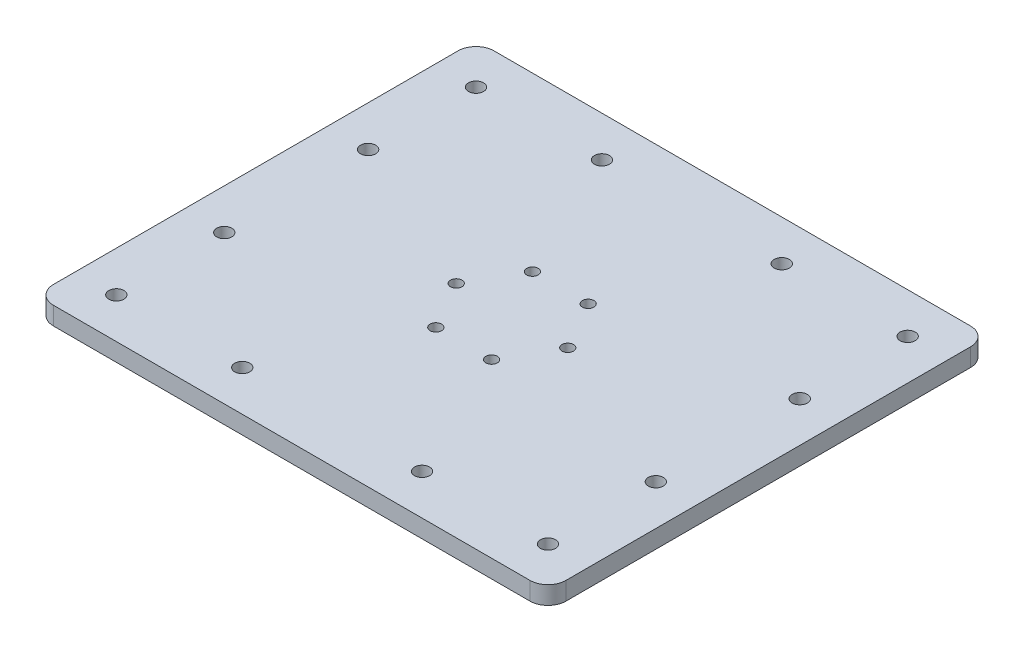
ISO-10303-21;
HEADER;
FILE_DESCRIPTION(('STEP AP214'),'2;1');
FILE_NAME('part.step','',(''),(''),'','','');
FILE_SCHEMA(('AUTOMOTIVE_DESIGN { 1 0 10303 214 1 1 1 1 }'));
ENDSEC;
DATA;
#1=APPLICATION_CONTEXT('core data for automotive mechanical design processes');
#2=APPLICATION_PROTOCOL_DEFINITION('international standard','automotive_design',2000,#1);
#3=PRODUCT_CONTEXT('',#1,'mechanical');
#4=PRODUCT('Part','Part','',(#3));
#5=PRODUCT_RELATED_PRODUCT_CATEGORY('part','',(#4));
#6=PRODUCT_DEFINITION_FORMATION('','',#4);
#7=PRODUCT_DEFINITION_CONTEXT('part definition',#1,'design');
#8=PRODUCT_DEFINITION('design','',#6,#7);
#9=PRODUCT_DEFINITION_SHAPE('','',#8);
#10=(LENGTH_UNIT() NAMED_UNIT(*) SI_UNIT(.MILLI.,.METRE.));
#11=(NAMED_UNIT(*) PLANE_ANGLE_UNIT() SI_UNIT($,.RADIAN.));
#12=(NAMED_UNIT(*) SI_UNIT($,.STERADIAN.) SOLID_ANGLE_UNIT());
#13=UNCERTAINTY_MEASURE_WITH_UNIT(LENGTH_MEASURE(1.E-05),#10,'distance_accuracy_value','');
#14=(GEOMETRIC_REPRESENTATION_CONTEXT(3) GLOBAL_UNCERTAINTY_ASSIGNED_CONTEXT((#13)) GLOBAL_UNIT_ASSIGNED_CONTEXT((#10,
#11,#12)) REPRESENTATION_CONTEXT('',''));
#15=CARTESIAN_POINT('',(0.,0.,0.));
#16=DIRECTION('',(0.,0.,1.));
#17=DIRECTION('',(1.,0.,0.));
#18=AXIS2_PLACEMENT_3D('',#15,#16,#17);
#19=CARTESIAN_POINT('',(-132.5,-10.,112.5));
#20=DIRECTION('',(0.,1.,0.));
#21=DIRECTION('',(0.,0.,1.));
#22=AXIS2_PLACEMENT_3D('',#19,#20,#21);
#23=CYLINDRICAL_SURFACE('',#22,10.);
#24=CARTESIAN_POINT('',(-132.5,0.,112.5));
#25=DIRECTION('',(0.,1.,0.));
#26=DIRECTION('',(0.,0.,-1.));
#27=AXIS2_PLACEMENT_3D('',#24,#25,#26);
#28=CIRCLE('',#27,10.);
#29=CARTESIAN_POINT('',(-142.5,0.,112.5));
#30=VERTEX_POINT('',#29);
#31=CARTESIAN_POINT('',(-132.5,0.,122.5));
#32=VERTEX_POINT('',#31);
#33=EDGE_CURVE('E139',#30,#32,#28,.T.);
#34=ORIENTED_EDGE('',*,*,#33,.F.);
#35=DIRECTION('',(0.,1.,0.));
#36=VECTOR('',#35,1.);
#37=CARTESIAN_POINT('',(-142.5,-10.,112.5));
#38=LINE('',#37,#36);
#39=CARTESIAN_POINT('',(-142.5,-10.,112.5));
#40=VERTEX_POINT('',#39);
#41=EDGE_CURVE('E11',#40,#30,#38,.T.);
#42=ORIENTED_EDGE('',*,*,#41,.F.);
#43=CARTESIAN_POINT('',(-132.5,-10.,112.5));
#44=DIRECTION('',(0.,1.,0.));
#45=DIRECTION('',(0.,0.,-1.));
#46=AXIS2_PLACEMENT_3D('',#43,#44,#45);
#47=CIRCLE('',#46,10.);
#48=CARTESIAN_POINT('',(-132.5,-10.,122.5));
#49=VERTEX_POINT('',#48);
#50=EDGE_CURVE('E160',#40,#49,#47,.T.);
#51=ORIENTED_EDGE('',*,*,#50,.T.);
#52=DIRECTION('',(0.,1.,0.));
#53=VECTOR('',#52,1.);
#54=CARTESIAN_POINT('',(-132.5,-10.,122.5));
#55=LINE('',#54,#53);
#56=EDGE_CURVE('E45',#49,#32,#55,.T.);
#57=ORIENTED_EDGE('',*,*,#56,.T.);
#58=EDGE_LOOP('',(#34,#42,#51,#57));
#59=FACE_BOUND('',#58,.T.);
#60=ADVANCED_FACE('F42',(#59),#23,.T.);
#61=CARTESIAN_POINT('',(-142.5,-10.,-112.5));
#62=DIRECTION('',(-1.,0.,0.));
#63=DIRECTION('',(0.,0.,1.));
#64=AXIS2_PLACEMENT_3D('',#61,#62,#63);
#65=PLANE('',#64);
#66=DIRECTION('',(0.,0.,1.));
#67=VECTOR('',#66,1.);
#68=CARTESIAN_POINT('',(-142.5,0.,-112.5));
#69=LINE('',#68,#67);
#70=CARTESIAN_POINT('',(-142.5,0.,-112.5));
#71=VERTEX_POINT('',#70);
#72=EDGE_CURVE('E158',#71,#30,#69,.T.);
#73=ORIENTED_EDGE('',*,*,#72,.F.);
#74=DIRECTION('',(0.,1.,0.));
#75=VECTOR('',#74,1.);
#76=CARTESIAN_POINT('',(-142.5,-10.,-112.5));
#77=LINE('',#76,#75);
#78=CARTESIAN_POINT('',(-142.5,-10.,-112.5));
#79=VERTEX_POINT('',#78);
#80=EDGE_CURVE('E51',#79,#71,#77,.T.);
#81=ORIENTED_EDGE('',*,*,#80,.F.);
#82=DIRECTION('',(0.,0.,1.));
#83=VECTOR('',#82,1.);
#84=CARTESIAN_POINT('',(-142.5,-10.,-112.5));
#85=LINE('',#84,#83);
#86=EDGE_CURVE('E129',#79,#40,#85,.T.);
#87=ORIENTED_EDGE('',*,*,#86,.T.);
#88=ORIENTED_EDGE('',*,*,#41,.T.);
#89=EDGE_LOOP('',(#73,#81,#87,#88));
#90=FACE_BOUND('',#89,.T.);
#91=ADVANCED_FACE('F172',(#90),#65,.T.);
#92=CARTESIAN_POINT('',(-132.5,-10.,-112.5));
#93=DIRECTION('',(0.,1.,0.));
#94=DIRECTION('',(0.,0.,1.));
#95=AXIS2_PLACEMENT_3D('',#92,#93,#94);
#96=CYLINDRICAL_SURFACE('',#95,10.);
#97=CARTESIAN_POINT('',(-132.5,0.,-112.5));
#98=DIRECTION('',(0.,1.,0.));
#99=DIRECTION('',(0.,0.,-1.));
#100=AXIS2_PLACEMENT_3D('',#97,#98,#99);
#101=CIRCLE('',#100,10.);
#102=CARTESIAN_POINT('',(-132.5,0.,-122.5));
#103=VERTEX_POINT('',#102);
#104=EDGE_CURVE('E116',#103,#71,#101,.T.);
#105=ORIENTED_EDGE('',*,*,#104,.F.);
#106=DIRECTION('',(0.,1.,0.));
#107=VECTOR('',#106,1.);
#108=CARTESIAN_POINT('',(-132.5,-10.,-122.5));
#109=LINE('',#108,#107);
#110=CARTESIAN_POINT('',(-132.5,-10.,-122.5));
#111=VERTEX_POINT('',#110);
#112=EDGE_CURVE('E111',#111,#103,#109,.T.);
#113=ORIENTED_EDGE('',*,*,#112,.F.);
#114=CARTESIAN_POINT('',(-132.5,-10.,-112.5));
#115=DIRECTION('',(0.,1.,0.));
#116=DIRECTION('',(0.,0.,-1.));
#117=AXIS2_PLACEMENT_3D('',#114,#115,#116);
#118=CIRCLE('',#117,10.);
#119=EDGE_CURVE('E114',#111,#79,#118,.T.);
#120=ORIENTED_EDGE('',*,*,#119,.T.);
#121=ORIENTED_EDGE('',*,*,#80,.T.);
#122=EDGE_LOOP('',(#105,#113,#120,#121));
#123=FACE_BOUND('',#122,.T.);
#124=ADVANCED_FACE('F113',(#123),#96,.T.);
#125=CARTESIAN_POINT('',(-132.5,-10.,-122.5));
#126=DIRECTION('',(0.,0.,-1.));
#127=DIRECTION('',(-1.,0.,0.));
#128=AXIS2_PLACEMENT_3D('',#125,#126,#127);
#129=PLANE('',#128);
#130=DIRECTION('',(-1.,0.,0.));
#131=VECTOR('',#130,1.);
#132=CARTESIAN_POINT('',(-132.5,0.,-122.5));
#133=LINE('',#132,#131);
#134=CARTESIAN_POINT('',(132.5,0.,-122.5));
#135=VERTEX_POINT('',#134);
#136=EDGE_CURVE('E155',#135,#103,#133,.T.);
#137=ORIENTED_EDGE('',*,*,#136,.F.);
#138=DIRECTION('',(0.,1.,0.));
#139=VECTOR('',#138,1.);
#140=CARTESIAN_POINT('',(132.5,-10.,-122.5));
#141=LINE('',#140,#139);
#142=CARTESIAN_POINT('',(132.5,-10.,-122.5));
#143=VERTEX_POINT('',#142);
#144=EDGE_CURVE('E121',#143,#135,#141,.T.);
#145=ORIENTED_EDGE('',*,*,#144,.F.);
#146=DIRECTION('',(-1.,0.,0.));
#147=VECTOR('',#146,1.);
#148=CARTESIAN_POINT('',(-132.5,-10.,-122.5));
#149=LINE('',#148,#147);
#150=EDGE_CURVE('E127',#143,#111,#149,.T.);
#151=ORIENTED_EDGE('',*,*,#150,.T.);
#152=ORIENTED_EDGE('',*,*,#112,.T.);
#153=EDGE_LOOP('',(#137,#145,#151,#152));
#154=FACE_BOUND('',#153,.T.);
#155=ADVANCED_FACE('F131',(#154),#129,.T.);
#156=CARTESIAN_POINT('',(132.5,-10.,-112.5));
#157=DIRECTION('',(0.,1.,0.));
#158=DIRECTION('',(0.,0.,1.));
#159=AXIS2_PLACEMENT_3D('',#156,#157,#158);
#160=CYLINDRICAL_SURFACE('',#159,10.);
#161=CARTESIAN_POINT('',(132.5,0.,-112.5));
#162=DIRECTION('',(0.,1.,0.));
#163=DIRECTION('',(0.,0.,1.));
#164=AXIS2_PLACEMENT_3D('',#161,#162,#163);
#165=CIRCLE('',#164,10.);
#166=CARTESIAN_POINT('',(142.5,0.,-112.5));
#167=VERTEX_POINT('',#166);
#168=EDGE_CURVE('E152',#167,#135,#165,.T.);
#169=ORIENTED_EDGE('',*,*,#168,.F.);
#170=DIRECTION('',(0.,1.,0.));
#171=VECTOR('',#170,1.);
#172=CARTESIAN_POINT('',(142.5,-10.,-112.5));
#173=LINE('',#172,#171);
#174=CARTESIAN_POINT('',(142.5,-10.,-112.5));
#175=VERTEX_POINT('',#174);
#176=EDGE_CURVE('E164',#175,#167,#173,.T.);
#177=ORIENTED_EDGE('',*,*,#176,.F.);
#178=CARTESIAN_POINT('',(132.5,-10.,-112.5));
#179=DIRECTION('',(0.,1.,0.));
#180=DIRECTION('',(0.,0.,1.));
#181=AXIS2_PLACEMENT_3D('',#178,#179,#180);
#182=CIRCLE('',#181,10.);
#183=EDGE_CURVE('E132',#175,#143,#182,.T.);
#184=ORIENTED_EDGE('',*,*,#183,.T.);
#185=ORIENTED_EDGE('',*,*,#144,.T.);
#186=EDGE_LOOP('',(#169,#177,#184,#185));
#187=FACE_BOUND('',#186,.T.);
#188=ADVANCED_FACE('F185',(#187),#160,.T.);
#189=CARTESIAN_POINT('',(142.5,-10.,-112.5));
#190=DIRECTION('',(1.,0.,0.));
#191=DIRECTION('',(0.,0.,-1.));
#192=AXIS2_PLACEMENT_3D('',#189,#190,#191);
#193=PLANE('',#192);
#194=DIRECTION('',(0.,0.,-1.));
#195=VECTOR('',#194,1.);
#196=CARTESIAN_POINT('',(142.5,0.,-112.5));
#197=LINE('',#196,#195);
#198=CARTESIAN_POINT('',(142.5,0.,112.5));
#199=VERTEX_POINT('',#198);
#200=EDGE_CURVE('E149',#199,#167,#197,.T.);
#201=ORIENTED_EDGE('',*,*,#200,.F.);
#202=DIRECTION('',(0.,1.,0.));
#203=VECTOR('',#202,1.);
#204=CARTESIAN_POINT('',(142.5,-10.,112.5));
#205=LINE('',#204,#203);
#206=CARTESIAN_POINT('',(142.5,-10.,112.5));
#207=VERTEX_POINT('',#206);
#208=EDGE_CURVE('E166',#207,#199,#205,.T.);
#209=ORIENTED_EDGE('',*,*,#208,.F.);
#210=DIRECTION('',(0.,0.,-1.));
#211=VECTOR('',#210,1.);
#212=CARTESIAN_POINT('',(142.5,-10.,-112.5));
#213=LINE('',#212,#211);
#214=EDGE_CURVE('E134',#207,#175,#213,.T.);
#215=ORIENTED_EDGE('',*,*,#214,.T.);
#216=ORIENTED_EDGE('',*,*,#176,.T.);
#217=EDGE_LOOP('',(#201,#209,#215,#216));
#218=FACE_BOUND('',#217,.T.);
#219=ADVANCED_FACE('F188',(#218),#193,.T.);
#220=CARTESIAN_POINT('',(132.5,-10.,112.5));
#221=DIRECTION('',(0.,1.,0.));
#222=DIRECTION('',(0.,0.,1.));
#223=AXIS2_PLACEMENT_3D('',#220,#221,#222);
#224=CYLINDRICAL_SURFACE('',#223,10.);
#225=CARTESIAN_POINT('',(132.5,0.,112.5));
#226=DIRECTION('',(0.,1.,0.));
#227=DIRECTION('',(0.,0.,1.));
#228=AXIS2_PLACEMENT_3D('',#225,#226,#227);
#229=CIRCLE('',#228,10.);
#230=CARTESIAN_POINT('',(132.5,0.,122.5));
#231=VERTEX_POINT('',#230);
#232=EDGE_CURVE('E146',#231,#199,#229,.T.);
#233=ORIENTED_EDGE('',*,*,#232,.F.);
#234=DIRECTION('',(0.,1.,0.));
#235=VECTOR('',#234,1.);
#236=CARTESIAN_POINT('',(132.5,-10.,122.5));
#237=LINE('',#236,#235);
#238=CARTESIAN_POINT('',(132.5,-10.,122.5));
#239=VERTEX_POINT('',#238);
#240=EDGE_CURVE('E167',#239,#231,#237,.T.);
#241=ORIENTED_EDGE('',*,*,#240,.F.);
#242=CARTESIAN_POINT('',(132.5,-10.,112.5));
#243=DIRECTION('',(0.,1.,0.));
#244=DIRECTION('',(0.,0.,1.));
#245=AXIS2_PLACEMENT_3D('',#242,#243,#244);
#246=CIRCLE('',#245,10.);
#247=EDGE_CURVE('E394',#239,#207,#246,.T.);
#248=ORIENTED_EDGE('',*,*,#247,.T.);
#249=ORIENTED_EDGE('',*,*,#208,.T.);
#250=EDGE_LOOP('',(#233,#241,#248,#249));
#251=FACE_BOUND('',#250,.T.);
#252=ADVANCED_FACE('F192',(#251),#224,.T.);
#253=CARTESIAN_POINT('',(-132.5,-10.,122.5));
#254=DIRECTION('',(0.,0.,1.));
#255=DIRECTION('',(1.,0.,0.));
#256=AXIS2_PLACEMENT_3D('',#253,#254,#255);
#257=PLANE('',#256);
#258=DIRECTION('',(1.,0.,0.));
#259=VECTOR('',#258,1.);
#260=CARTESIAN_POINT('',(-132.5,0.,122.5));
#261=LINE('',#260,#259);
#262=EDGE_CURVE('E142',#32,#231,#261,.T.);
#263=ORIENTED_EDGE('',*,*,#262,.F.);
#264=ORIENTED_EDGE('',*,*,#56,.F.);
#265=DIRECTION('',(1.,0.,0.));
#266=VECTOR('',#265,1.);
#267=CARTESIAN_POINT('',(-132.5,-10.,122.5));
#268=LINE('',#267,#266);
#269=EDGE_CURVE('E392',#49,#239,#268,.T.);
#270=ORIENTED_EDGE('',*,*,#269,.T.);
#271=ORIENTED_EDGE('',*,*,#240,.T.);
#272=EDGE_LOOP('',(#263,#264,#270,#271));
#273=FACE_BOUND('',#272,.T.);
#274=ADVANCED_FACE('F169',(#273),#257,.T.);
#275=CARTESIAN_POINT('',(-132.5,-10.,112.5));
#276=DIRECTION('',(0.,-1.,0.));
#277=DIRECTION('',(0.,0.,-1.));
#278=AXIS2_PLACEMENT_3D('',#275,#276,#277);
#279=PLANE('',#278);
#280=CARTESIAN_POINT('',(15.5000000000003,-10.,-26.8467875173174));
#281=DIRECTION('',(0.,1.,0.));
#282=DIRECTION('',(0.,0.,1.));
#283=AXIS2_PLACEMENT_3D('',#280,#281,#282);
#284=CIRCLE('',#283,3.2);
#285=CARTESIAN_POINT('',(15.5000000000003,-10.,-23.6467875173174));
#286=VERTEX_POINT('',#285);
#287=EDGE_CURVE('E283',#286,#286,#284,.T.);
#288=ORIENTED_EDGE('',*,*,#287,.T.);
#289=EDGE_LOOP('',(#288));
#290=FACE_BOUND('',#289,.T.);
#291=CARTESIAN_POINT('',(-15.4999999999997,-10.,-26.8467875173177));
#292=DIRECTION('',(0.,1.,0.));
#293=DIRECTION('',(0.,0.,1.));
#294=AXIS2_PLACEMENT_3D('',#291,#292,#293);
#295=CIRCLE('',#294,3.2);
#296=CARTESIAN_POINT('',(-15.4999999999997,-10.,-23.6467875173177));
#297=VERTEX_POINT('',#296);
#298=EDGE_CURVE('E291',#297,#297,#295,.T.);
#299=ORIENTED_EDGE('',*,*,#298,.T.);
#300=EDGE_LOOP('',(#299));
#301=FACE_BOUND('',#300,.T.);
#302=CARTESIAN_POINT('',(-31.,-10.,-2.16471843008274E-13));
#303=DIRECTION('',(0.,1.,0.));
#304=DIRECTION('',(0.,0.,1.));
#305=AXIS2_PLACEMENT_3D('',#302,#303,#304);
#306=CIRCLE('',#305,3.2);
#307=CARTESIAN_POINT('',(-31.,-10.,3.19999999999979));
#308=VERTEX_POINT('',#307);
#309=EDGE_CURVE('E297',#308,#308,#306,.T.);
#310=ORIENTED_EDGE('',*,*,#309,.T.);
#311=EDGE_LOOP('',(#310));
#312=FACE_BOUND('',#311,.T.);
#313=CARTESIAN_POINT('',(-15.5000000000001,-10.,26.8467875173175));
#314=DIRECTION('',(0.,1.,0.));
#315=DIRECTION('',(0.,0.,1.));
#316=AXIS2_PLACEMENT_3D('',#313,#314,#315);
#317=CIRCLE('',#316,3.20000000000001);
#318=CARTESIAN_POINT('',(-15.5000000000001,-10.,30.0467875173175));
#319=VERTEX_POINT('',#318);
#320=EDGE_CURVE('E303',#319,#319,#317,.T.);
#321=ORIENTED_EDGE('',*,*,#320,.T.);
#322=EDGE_LOOP('',(#321));
#323=FACE_BOUND('',#322,.T.);
#324=CARTESIAN_POINT('',(15.4999999999999,-10.,26.8467875173176));
#325=DIRECTION('',(0.,1.,0.));
#326=DIRECTION('',(0.,0.,1.));
#327=AXIS2_PLACEMENT_3D('',#324,#325,#326);
#328=CIRCLE('',#327,3.2);
#329=CARTESIAN_POINT('',(15.4999999999999,-10.,30.0467875173176));
#330=VERTEX_POINT('',#329);
#331=EDGE_CURVE('E309',#330,#330,#328,.T.);
#332=ORIENTED_EDGE('',*,*,#331,.T.);
#333=EDGE_LOOP('',(#332));
#334=FACE_BOUND('',#333,.T.);
#335=CARTESIAN_POINT('',(31.,-10.,0.));
#336=DIRECTION('',(0.,1.,0.));
#337=DIRECTION('',(0.,0.,1.));
#338=AXIS2_PLACEMENT_3D('',#335,#336,#337);
#339=CIRCLE('',#338,3.2);
#340=CARTESIAN_POINT('',(31.,-10.,3.2));
#341=VERTEX_POINT('',#340);
#342=EDGE_CURVE('E315',#341,#341,#339,.T.);
#343=ORIENTED_EDGE('',*,*,#342,.T.);
#344=EDGE_LOOP('',(#343));
#345=FACE_BOUND('',#344,.T.);
#346=CARTESIAN_POINT('',(-120.,-10.,100.));
#347=DIRECTION('',(0.,1.,0.));
#348=DIRECTION('',(0.,0.,1.));
#349=AXIS2_PLACEMENT_3D('',#346,#347,#348);
#350=CIRCLE('',#349,4.19999999999999);
#351=CARTESIAN_POINT('',(-120.,-10.,104.2));
#352=VERTEX_POINT('',#351);
#353=EDGE_CURVE('E321',#352,#352,#350,.T.);
#354=ORIENTED_EDGE('',*,*,#353,.T.);
#355=EDGE_LOOP('',(#354));
#356=FACE_BOUND('',#355,.T.);
#357=CARTESIAN_POINT('',(-50.,-10.,100.));
#358=DIRECTION('',(0.,1.,0.));
#359=DIRECTION('',(0.,0.,1.));
#360=AXIS2_PLACEMENT_3D('',#357,#358,#359);
#361=CIRCLE('',#360,4.2);
#362=CARTESIAN_POINT('',(-50.,-10.,104.2));
#363=VERTEX_POINT('',#362);
#364=EDGE_CURVE('E327',#363,#363,#361,.T.);
#365=ORIENTED_EDGE('',*,*,#364,.T.);
#366=EDGE_LOOP('',(#365));
#367=FACE_BOUND('',#366,.T.);
#368=CARTESIAN_POINT('',(50.,-10.,100.));
#369=DIRECTION('',(0.,1.,0.));
#370=DIRECTION('',(0.,0.,1.));
#371=AXIS2_PLACEMENT_3D('',#368,#369,#370);
#372=CIRCLE('',#371,4.2);
#373=CARTESIAN_POINT('',(50.,-10.,104.2));
#374=VERTEX_POINT('',#373);
#375=EDGE_CURVE('E333',#374,#374,#372,.T.);
#376=ORIENTED_EDGE('',*,*,#375,.T.);
#377=EDGE_LOOP('',(#376));
#378=FACE_BOUND('',#377,.T.);
#379=CARTESIAN_POINT('',(120.,-10.,100.));
#380=DIRECTION('',(0.,1.,0.));
#381=DIRECTION('',(0.,0.,1.));
#382=AXIS2_PLACEMENT_3D('',#379,#380,#381);
#383=CIRCLE('',#382,4.19999999999999);
#384=CARTESIAN_POINT('',(120.,-10.,104.2));
#385=VERTEX_POINT('',#384);
#386=EDGE_CURVE('E339',#385,#385,#383,.T.);
#387=ORIENTED_EDGE('',*,*,#386,.T.);
#388=EDGE_LOOP('',(#387));
#389=FACE_BOUND('',#388,.T.);
#390=CARTESIAN_POINT('',(120.,-10.,-100.));
#391=DIRECTION('',(0.,1.,0.));
#392=DIRECTION('',(0.,0.,1.));
#393=AXIS2_PLACEMENT_3D('',#390,#391,#392);
#394=CIRCLE('',#393,4.19999999999999);
#395=CARTESIAN_POINT('',(120.,-10.,-95.8));
#396=VERTEX_POINT('',#395);
#397=EDGE_CURVE('E345',#396,#396,#394,.T.);
#398=ORIENTED_EDGE('',*,*,#397,.T.);
#399=EDGE_LOOP('',(#398));
#400=FACE_BOUND('',#399,.T.);
#401=CARTESIAN_POINT('',(50.,-10.,-99.9999999999999));
#402=DIRECTION('',(0.,1.,0.));
#403=DIRECTION('',(0.,0.,1.));
#404=AXIS2_PLACEMENT_3D('',#401,#402,#403);
#405=CIRCLE('',#404,4.2);
#406=CARTESIAN_POINT('',(50.,-10.,-95.8));
#407=VERTEX_POINT('',#406);
#408=EDGE_CURVE('E351',#407,#407,#405,.T.);
#409=ORIENTED_EDGE('',*,*,#408,.T.);
#410=EDGE_LOOP('',(#409));
#411=FACE_BOUND('',#410,.T.);
#412=CARTESIAN_POINT('',(-50.,-10.,-99.9999999999999));
#413=DIRECTION('',(0.,1.,0.));
#414=DIRECTION('',(0.,0.,1.));
#415=AXIS2_PLACEMENT_3D('',#412,#413,#414);
#416=CIRCLE('',#415,4.2);
#417=CARTESIAN_POINT('',(-50.,-10.,-95.8));
#418=VERTEX_POINT('',#417);
#419=EDGE_CURVE('E357',#418,#418,#416,.T.);
#420=ORIENTED_EDGE('',*,*,#419,.T.);
#421=EDGE_LOOP('',(#420));
#422=FACE_BOUND('',#421,.T.);
#423=CARTESIAN_POINT('',(-120.,-10.,-100.));
#424=DIRECTION('',(0.,1.,0.));
#425=DIRECTION('',(0.,0.,1.));
#426=AXIS2_PLACEMENT_3D('',#423,#424,#425);
#427=CIRCLE('',#426,4.19999999999999);
#428=CARTESIAN_POINT('',(-120.,-10.,-95.8));
#429=VERTEX_POINT('',#428);
#430=EDGE_CURVE('E363',#429,#429,#427,.T.);
#431=ORIENTED_EDGE('',*,*,#430,.T.);
#432=EDGE_LOOP('',(#431));
#433=FACE_BOUND('',#432,.T.);
#434=CARTESIAN_POINT('',(-120.,-10.,40.));
#435=DIRECTION('',(0.,1.,0.));
#436=DIRECTION('',(0.,0.,1.));
#437=AXIS2_PLACEMENT_3D('',#434,#435,#436);
#438=CIRCLE('',#437,4.2);
#439=CARTESIAN_POINT('',(-120.,-10.,44.2));
#440=VERTEX_POINT('',#439);
#441=EDGE_CURVE('E369',#440,#440,#438,.T.);
#442=ORIENTED_EDGE('',*,*,#441,.T.);
#443=EDGE_LOOP('',(#442));
#444=FACE_BOUND('',#443,.T.);
#445=CARTESIAN_POINT('',(-120.,-10.,-40.));
#446=DIRECTION('',(0.,1.,0.));
#447=DIRECTION('',(0.,0.,1.));
#448=AXIS2_PLACEMENT_3D('',#445,#446,#447);
#449=CIRCLE('',#448,4.2);
#450=CARTESIAN_POINT('',(-120.,-10.,-35.8));
#451=VERTEX_POINT('',#450);
#452=EDGE_CURVE('E375',#451,#451,#449,.T.);
#453=ORIENTED_EDGE('',*,*,#452,.T.);
#454=EDGE_LOOP('',(#453));
#455=FACE_BOUND('',#454,.T.);
#456=CARTESIAN_POINT('',(120.,-10.,40.));
#457=DIRECTION('',(0.,1.,0.));
#458=DIRECTION('',(0.,0.,1.));
#459=AXIS2_PLACEMENT_3D('',#456,#457,#458);
#460=CIRCLE('',#459,4.2);
#461=CARTESIAN_POINT('',(120.,-10.,44.2));
#462=VERTEX_POINT('',#461);
#463=EDGE_CURVE('E381',#462,#462,#460,.T.);
#464=ORIENTED_EDGE('',*,*,#463,.T.);
#465=EDGE_LOOP('',(#464));
#466=FACE_BOUND('',#465,.T.);
#467=CARTESIAN_POINT('',(120.,-10.,-40.));
#468=DIRECTION('',(0.,1.,0.));
#469=DIRECTION('',(0.,0.,1.));
#470=AXIS2_PLACEMENT_3D('',#467,#468,#469);
#471=CIRCLE('',#470,4.2);
#472=CARTESIAN_POINT('',(120.,-10.,-35.8));
#473=VERTEX_POINT('',#472);
#474=EDGE_CURVE('E143',#473,#473,#471,.T.);
#475=ORIENTED_EDGE('',*,*,#474,.T.);
#476=EDGE_LOOP('',(#475));
#477=FACE_BOUND('',#476,.T.);
#478=ORIENTED_EDGE('',*,*,#50,.F.);
#479=ORIENTED_EDGE('',*,*,#86,.F.);
#480=ORIENTED_EDGE('',*,*,#119,.F.);
#481=ORIENTED_EDGE('',*,*,#150,.F.);
#482=ORIENTED_EDGE('',*,*,#183,.F.);
#483=ORIENTED_EDGE('',*,*,#214,.F.);
#484=ORIENTED_EDGE('',*,*,#247,.F.);
#485=ORIENTED_EDGE('',*,*,#269,.F.);
#486=EDGE_LOOP('',(#478,#479,#480,#481,#482,#483,#484,#485));
#487=FACE_BOUND('',#486,.T.);
#488=ADVANCED_FACE('F125',(#290,#301,#312,#323,#334,#345,#356,#367,#378,#389,#400,#411,#422,
#433,#444,#455,#466,#477,#487),#279,.T.);
#489=CARTESIAN_POINT('',(-132.5,0.,112.5));
#490=DIRECTION('',(0.,-1.,0.));
#491=DIRECTION('',(0.,0.,-1.));
#492=AXIS2_PLACEMENT_3D('',#489,#490,#491);
#493=PLANE('',#492);
#494=CARTESIAN_POINT('',(15.5000000000003,0.,-26.8467875173174));
#495=DIRECTION('',(0.,1.,0.));
#496=DIRECTION('',(0.,0.,1.));
#497=AXIS2_PLACEMENT_3D('',#494,#495,#496);
#498=CIRCLE('',#497,3.2);
#499=CARTESIAN_POINT('',(15.5000000000003,0.,-23.6467875173174));
#500=VERTEX_POINT('',#499);
#501=EDGE_CURVE('E286',#500,#500,#498,.T.);
#502=ORIENTED_EDGE('',*,*,#501,.F.);
#503=EDGE_LOOP('',(#502));
#504=FACE_BOUND('',#503,.T.);
#505=CARTESIAN_POINT('',(-15.4999999999997,0.,-26.8467875173177));
#506=DIRECTION('',(0.,1.,0.));
#507=DIRECTION('',(0.,0.,1.));
#508=AXIS2_PLACEMENT_3D('',#505,#506,#507);
#509=CIRCLE('',#508,3.2);
#510=CARTESIAN_POINT('',(-15.4999999999997,0.,-23.6467875173177));
#511=VERTEX_POINT('',#510);
#512=EDGE_CURVE('E288',#511,#511,#509,.T.);
#513=ORIENTED_EDGE('',*,*,#512,.F.);
#514=EDGE_LOOP('',(#513));
#515=FACE_BOUND('',#514,.T.);
#516=CARTESIAN_POINT('',(-31.,0.,-2.16471843008274E-13));
#517=DIRECTION('',(0.,1.,0.));
#518=DIRECTION('',(0.,0.,1.));
#519=AXIS2_PLACEMENT_3D('',#516,#517,#518);
#520=CIRCLE('',#519,3.2);
#521=CARTESIAN_POINT('',(-31.,0.,3.19999999999979));
#522=VERTEX_POINT('',#521);
#523=EDGE_CURVE('E294',#522,#522,#520,.T.);
#524=ORIENTED_EDGE('',*,*,#523,.F.);
#525=EDGE_LOOP('',(#524));
#526=FACE_BOUND('',#525,.T.);
#527=CARTESIAN_POINT('',(-15.5000000000001,0.,26.8467875173175));
#528=DIRECTION('',(0.,1.,0.));
#529=DIRECTION('',(0.,0.,1.));
#530=AXIS2_PLACEMENT_3D('',#527,#528,#529);
#531=CIRCLE('',#530,3.20000000000001);
#532=CARTESIAN_POINT('',(-15.5000000000001,0.,30.0467875173175));
#533=VERTEX_POINT('',#532);
#534=EDGE_CURVE('E300',#533,#533,#531,.T.);
#535=ORIENTED_EDGE('',*,*,#534,.F.);
#536=EDGE_LOOP('',(#535));
#537=FACE_BOUND('',#536,.T.);
#538=CARTESIAN_POINT('',(15.4999999999999,0.,26.8467875173176));
#539=DIRECTION('',(0.,1.,0.));
#540=DIRECTION('',(0.,0.,1.));
#541=AXIS2_PLACEMENT_3D('',#538,#539,#540);
#542=CIRCLE('',#541,3.2);
#543=CARTESIAN_POINT('',(15.4999999999999,0.,30.0467875173176));
#544=VERTEX_POINT('',#543);
#545=EDGE_CURVE('E306',#544,#544,#542,.T.);
#546=ORIENTED_EDGE('',*,*,#545,.F.);
#547=EDGE_LOOP('',(#546));
#548=FACE_BOUND('',#547,.T.);
#549=CARTESIAN_POINT('',(31.,0.,0.));
#550=DIRECTION('',(0.,1.,0.));
#551=DIRECTION('',(0.,0.,1.));
#552=AXIS2_PLACEMENT_3D('',#549,#550,#551);
#553=CIRCLE('',#552,3.2);
#554=CARTESIAN_POINT('',(31.,0.,3.2));
#555=VERTEX_POINT('',#554);
#556=EDGE_CURVE('E312',#555,#555,#553,.T.);
#557=ORIENTED_EDGE('',*,*,#556,.F.);
#558=EDGE_LOOP('',(#557));
#559=FACE_BOUND('',#558,.T.);
#560=CARTESIAN_POINT('',(-120.,0.,100.));
#561=DIRECTION('',(0.,1.,0.));
#562=DIRECTION('',(0.,0.,1.));
#563=AXIS2_PLACEMENT_3D('',#560,#561,#562);
#564=CIRCLE('',#563,4.19999999999999);
#565=CARTESIAN_POINT('',(-120.,0.,104.2));
#566=VERTEX_POINT('',#565);
#567=EDGE_CURVE('E318',#566,#566,#564,.T.);
#568=ORIENTED_EDGE('',*,*,#567,.F.);
#569=EDGE_LOOP('',(#568));
#570=FACE_BOUND('',#569,.T.);
#571=CARTESIAN_POINT('',(-50.,0.,100.));
#572=DIRECTION('',(0.,1.,0.));
#573=DIRECTION('',(0.,0.,1.));
#574=AXIS2_PLACEMENT_3D('',#571,#572,#573);
#575=CIRCLE('',#574,4.2);
#576=CARTESIAN_POINT('',(-50.,0.,104.2));
#577=VERTEX_POINT('',#576);
#578=EDGE_CURVE('E324',#577,#577,#575,.T.);
#579=ORIENTED_EDGE('',*,*,#578,.F.);
#580=EDGE_LOOP('',(#579));
#581=FACE_BOUND('',#580,.T.);
#582=CARTESIAN_POINT('',(50.,0.,100.));
#583=DIRECTION('',(0.,1.,0.));
#584=DIRECTION('',(0.,0.,1.));
#585=AXIS2_PLACEMENT_3D('',#582,#583,#584);
#586=CIRCLE('',#585,4.2);
#587=CARTESIAN_POINT('',(50.,0.,104.2));
#588=VERTEX_POINT('',#587);
#589=EDGE_CURVE('E330',#588,#588,#586,.T.);
#590=ORIENTED_EDGE('',*,*,#589,.F.);
#591=EDGE_LOOP('',(#590));
#592=FACE_BOUND('',#591,.T.);
#593=CARTESIAN_POINT('',(120.,0.,100.));
#594=DIRECTION('',(0.,1.,0.));
#595=DIRECTION('',(0.,0.,1.));
#596=AXIS2_PLACEMENT_3D('',#593,#594,#595);
#597=CIRCLE('',#596,4.19999999999999);
#598=CARTESIAN_POINT('',(120.,0.,104.2));
#599=VERTEX_POINT('',#598);
#600=EDGE_CURVE('E336',#599,#599,#597,.T.);
#601=ORIENTED_EDGE('',*,*,#600,.F.);
#602=EDGE_LOOP('',(#601));
#603=FACE_BOUND('',#602,.T.);
#604=CARTESIAN_POINT('',(120.,0.,-100.));
#605=DIRECTION('',(0.,1.,0.));
#606=DIRECTION('',(0.,0.,1.));
#607=AXIS2_PLACEMENT_3D('',#604,#605,#606);
#608=CIRCLE('',#607,4.19999999999999);
#609=CARTESIAN_POINT('',(120.,0.,-95.8));
#610=VERTEX_POINT('',#609);
#611=EDGE_CURVE('E342',#610,#610,#608,.T.);
#612=ORIENTED_EDGE('',*,*,#611,.F.);
#613=EDGE_LOOP('',(#612));
#614=FACE_BOUND('',#613,.T.);
#615=CARTESIAN_POINT('',(50.,0.,-99.9999999999999));
#616=DIRECTION('',(0.,1.,0.));
#617=DIRECTION('',(0.,0.,1.));
#618=AXIS2_PLACEMENT_3D('',#615,#616,#617);
#619=CIRCLE('',#618,4.2);
#620=CARTESIAN_POINT('',(50.,0.,-95.8));
#621=VERTEX_POINT('',#620);
#622=EDGE_CURVE('E348',#621,#621,#619,.T.);
#623=ORIENTED_EDGE('',*,*,#622,.F.);
#624=EDGE_LOOP('',(#623));
#625=FACE_BOUND('',#624,.T.);
#626=CARTESIAN_POINT('',(-50.,0.,-99.9999999999999));
#627=DIRECTION('',(0.,1.,0.));
#628=DIRECTION('',(0.,0.,1.));
#629=AXIS2_PLACEMENT_3D('',#626,#627,#628);
#630=CIRCLE('',#629,4.2);
#631=CARTESIAN_POINT('',(-50.,0.,-95.8));
#632=VERTEX_POINT('',#631);
#633=EDGE_CURVE('E354',#632,#632,#630,.T.);
#634=ORIENTED_EDGE('',*,*,#633,.F.);
#635=EDGE_LOOP('',(#634));
#636=FACE_BOUND('',#635,.T.);
#637=CARTESIAN_POINT('',(-120.,0.,-100.));
#638=DIRECTION('',(0.,1.,0.));
#639=DIRECTION('',(0.,0.,1.));
#640=AXIS2_PLACEMENT_3D('',#637,#638,#639);
#641=CIRCLE('',#640,4.19999999999999);
#642=CARTESIAN_POINT('',(-120.,0.,-95.8));
#643=VERTEX_POINT('',#642);
#644=EDGE_CURVE('E360',#643,#643,#641,.T.);
#645=ORIENTED_EDGE('',*,*,#644,.F.);
#646=EDGE_LOOP('',(#645));
#647=FACE_BOUND('',#646,.T.);
#648=CARTESIAN_POINT('',(-120.,0.,40.));
#649=DIRECTION('',(0.,1.,0.));
#650=DIRECTION('',(0.,0.,1.));
#651=AXIS2_PLACEMENT_3D('',#648,#649,#650);
#652=CIRCLE('',#651,4.2);
#653=CARTESIAN_POINT('',(-120.,0.,44.2));
#654=VERTEX_POINT('',#653);
#655=EDGE_CURVE('E366',#654,#654,#652,.T.);
#656=ORIENTED_EDGE('',*,*,#655,.F.);
#657=EDGE_LOOP('',(#656));
#658=FACE_BOUND('',#657,.T.);
#659=CARTESIAN_POINT('',(-120.,0.,-40.));
#660=DIRECTION('',(0.,1.,0.));
#661=DIRECTION('',(0.,0.,1.));
#662=AXIS2_PLACEMENT_3D('',#659,#660,#661);
#663=CIRCLE('',#662,4.2);
#664=CARTESIAN_POINT('',(-120.,0.,-35.8));
#665=VERTEX_POINT('',#664);
#666=EDGE_CURVE('E372',#665,#665,#663,.T.);
#667=ORIENTED_EDGE('',*,*,#666,.F.);
#668=EDGE_LOOP('',(#667));
#669=FACE_BOUND('',#668,.T.);
#670=CARTESIAN_POINT('',(120.,0.,40.));
#671=DIRECTION('',(0.,1.,0.));
#672=DIRECTION('',(0.,0.,1.));
#673=AXIS2_PLACEMENT_3D('',#670,#671,#672);
#674=CIRCLE('',#673,4.2);
#675=CARTESIAN_POINT('',(120.,0.,44.2));
#676=VERTEX_POINT('',#675);
#677=EDGE_CURVE('E378',#676,#676,#674,.T.);
#678=ORIENTED_EDGE('',*,*,#677,.F.);
#679=EDGE_LOOP('',(#678));
#680=FACE_BOUND('',#679,.T.);
#681=CARTESIAN_POINT('',(120.,0.,-40.));
#682=DIRECTION('',(0.,1.,0.));
#683=DIRECTION('',(0.,0.,1.));
#684=AXIS2_PLACEMENT_3D('',#681,#682,#683);
#685=CIRCLE('',#684,4.2);
#686=CARTESIAN_POINT('',(120.,0.,-35.8));
#687=VERTEX_POINT('',#686);
#688=EDGE_CURVE('E384',#687,#687,#685,.T.);
#689=ORIENTED_EDGE('',*,*,#688,.F.);
#690=EDGE_LOOP('',(#689));
#691=FACE_BOUND('',#690,.T.);
#692=ORIENTED_EDGE('',*,*,#33,.T.);
#693=ORIENTED_EDGE('',*,*,#262,.T.);
#694=ORIENTED_EDGE('',*,*,#232,.T.);
#695=ORIENTED_EDGE('',*,*,#200,.T.);
#696=ORIENTED_EDGE('',*,*,#168,.T.);
#697=ORIENTED_EDGE('',*,*,#136,.T.);
#698=ORIENTED_EDGE('',*,*,#104,.T.);
#699=ORIENTED_EDGE('',*,*,#72,.T.);
#700=EDGE_LOOP('',(#692,#693,#694,#695,#696,#697,#698,#699));
#701=FACE_BOUND('',#700,.T.);
#702=ADVANCED_FACE('F171',(#504,#515,#526,#537,#548,#559,#570,#581,#592,#603,#614,#625,#636,
#647,#658,#669,#680,#691,#701),#493,.F.);
#703=CARTESIAN_POINT('',(120.,-10.,-40.));
#704=DIRECTION('',(0.,1.,0.));
#705=DIRECTION('',(0.,0.,1.));
#706=AXIS2_PLACEMENT_3D('',#703,#704,#705);
#707=CYLINDRICAL_SURFACE('',#706,4.2);
#708=ORIENTED_EDGE('',*,*,#474,.F.);
#709=EDGE_LOOP('',(#708));
#710=FACE_BOUND('',#709,.T.);
#711=ORIENTED_EDGE('',*,*,#688,.T.);
#712=EDGE_LOOP('',(#711));
#713=FACE_BOUND('',#712,.T.);
#714=ADVANCED_FACE('F204',(#710,#713),#707,.F.);
#715=CARTESIAN_POINT('',(120.,-10.,40.));
#716=DIRECTION('',(0.,1.,0.));
#717=DIRECTION('',(0.,0.,1.));
#718=AXIS2_PLACEMENT_3D('',#715,#716,#717);
#719=CYLINDRICAL_SURFACE('',#718,4.2);
#720=ORIENTED_EDGE('',*,*,#463,.F.);
#721=EDGE_LOOP('',(#720));
#722=FACE_BOUND('',#721,.T.);
#723=ORIENTED_EDGE('',*,*,#677,.T.);
#724=EDGE_LOOP('',(#723));
#725=FACE_BOUND('',#724,.T.);
#726=ADVANCED_FACE('F211',(#722,#725),#719,.F.);
#727=CARTESIAN_POINT('',(-120.,-10.,-40.));
#728=DIRECTION('',(0.,1.,0.));
#729=DIRECTION('',(0.,0.,1.));
#730=AXIS2_PLACEMENT_3D('',#727,#728,#729);
#731=CYLINDRICAL_SURFACE('',#730,4.2);
#732=ORIENTED_EDGE('',*,*,#452,.F.);
#733=EDGE_LOOP('',(#732));
#734=FACE_BOUND('',#733,.T.);
#735=ORIENTED_EDGE('',*,*,#666,.T.);
#736=EDGE_LOOP('',(#735));
#737=FACE_BOUND('',#736,.T.);
#738=ADVANCED_FACE('F215',(#734,#737),#731,.F.);
#739=CARTESIAN_POINT('',(-120.,-10.,40.));
#740=DIRECTION('',(0.,1.,0.));
#741=DIRECTION('',(0.,0.,1.));
#742=AXIS2_PLACEMENT_3D('',#739,#740,#741);
#743=CYLINDRICAL_SURFACE('',#742,4.2);
#744=ORIENTED_EDGE('',*,*,#441,.F.);
#745=EDGE_LOOP('',(#744));
#746=FACE_BOUND('',#745,.T.);
#747=ORIENTED_EDGE('',*,*,#655,.T.);
#748=EDGE_LOOP('',(#747));
#749=FACE_BOUND('',#748,.T.);
#750=ADVANCED_FACE('F219',(#746,#749),#743,.F.);
#751=CARTESIAN_POINT('',(-120.,-10.,-100.));
#752=DIRECTION('',(0.,1.,0.));
#753=DIRECTION('',(0.,0.,1.));
#754=AXIS2_PLACEMENT_3D('',#751,#752,#753);
#755=CYLINDRICAL_SURFACE('',#754,4.19999999999999);
#756=ORIENTED_EDGE('',*,*,#430,.F.);
#757=EDGE_LOOP('',(#756));
#758=FACE_BOUND('',#757,.T.);
#759=ORIENTED_EDGE('',*,*,#644,.T.);
#760=EDGE_LOOP('',(#759));
#761=FACE_BOUND('',#760,.T.);
#762=ADVANCED_FACE('F223',(#758,#761),#755,.F.);
#763=CARTESIAN_POINT('',(-50.,-10.,-99.9999999999999));
#764=DIRECTION('',(0.,1.,0.));
#765=DIRECTION('',(0.,0.,1.));
#766=AXIS2_PLACEMENT_3D('',#763,#764,#765);
#767=CYLINDRICAL_SURFACE('',#766,4.2);
#768=ORIENTED_EDGE('',*,*,#419,.F.);
#769=EDGE_LOOP('',(#768));
#770=FACE_BOUND('',#769,.T.);
#771=ORIENTED_EDGE('',*,*,#633,.T.);
#772=EDGE_LOOP('',(#771));
#773=FACE_BOUND('',#772,.T.);
#774=ADVANCED_FACE('F227',(#770,#773),#767,.F.);
#775=CARTESIAN_POINT('',(50.,-10.,-99.9999999999999));
#776=DIRECTION('',(0.,1.,0.));
#777=DIRECTION('',(0.,0.,1.));
#778=AXIS2_PLACEMENT_3D('',#775,#776,#777);
#779=CYLINDRICAL_SURFACE('',#778,4.2);
#780=ORIENTED_EDGE('',*,*,#408,.F.);
#781=EDGE_LOOP('',(#780));
#782=FACE_BOUND('',#781,.T.);
#783=ORIENTED_EDGE('',*,*,#622,.T.);
#784=EDGE_LOOP('',(#783));
#785=FACE_BOUND('',#784,.T.);
#786=ADVANCED_FACE('F231',(#782,#785),#779,.F.);
#787=CARTESIAN_POINT('',(120.,-10.,-100.));
#788=DIRECTION('',(0.,1.,0.));
#789=DIRECTION('',(0.,0.,1.));
#790=AXIS2_PLACEMENT_3D('',#787,#788,#789);
#791=CYLINDRICAL_SURFACE('',#790,4.19999999999999);
#792=ORIENTED_EDGE('',*,*,#397,.F.);
#793=EDGE_LOOP('',(#792));
#794=FACE_BOUND('',#793,.T.);
#795=ORIENTED_EDGE('',*,*,#611,.T.);
#796=EDGE_LOOP('',(#795));
#797=FACE_BOUND('',#796,.T.);
#798=ADVANCED_FACE('F235',(#794,#797),#791,.F.);
#799=CARTESIAN_POINT('',(120.,-10.,100.));
#800=DIRECTION('',(0.,1.,0.));
#801=DIRECTION('',(0.,0.,1.));
#802=AXIS2_PLACEMENT_3D('',#799,#800,#801);
#803=CYLINDRICAL_SURFACE('',#802,4.19999999999999);
#804=ORIENTED_EDGE('',*,*,#386,.F.);
#805=EDGE_LOOP('',(#804));
#806=FACE_BOUND('',#805,.T.);
#807=ORIENTED_EDGE('',*,*,#600,.T.);
#808=EDGE_LOOP('',(#807));
#809=FACE_BOUND('',#808,.T.);
#810=ADVANCED_FACE('F239',(#806,#809),#803,.F.);
#811=CARTESIAN_POINT('',(50.,-10.,100.));
#812=DIRECTION('',(0.,1.,0.));
#813=DIRECTION('',(0.,0.,1.));
#814=AXIS2_PLACEMENT_3D('',#811,#812,#813);
#815=CYLINDRICAL_SURFACE('',#814,4.2);
#816=ORIENTED_EDGE('',*,*,#375,.F.);
#817=EDGE_LOOP('',(#816));
#818=FACE_BOUND('',#817,.T.);
#819=ORIENTED_EDGE('',*,*,#589,.T.);
#820=EDGE_LOOP('',(#819));
#821=FACE_BOUND('',#820,.T.);
#822=ADVANCED_FACE('F243',(#818,#821),#815,.F.);
#823=CARTESIAN_POINT('',(-50.,-10.,100.));
#824=DIRECTION('',(0.,1.,0.));
#825=DIRECTION('',(0.,0.,1.));
#826=AXIS2_PLACEMENT_3D('',#823,#824,#825);
#827=CYLINDRICAL_SURFACE('',#826,4.2);
#828=ORIENTED_EDGE('',*,*,#364,.F.);
#829=EDGE_LOOP('',(#828));
#830=FACE_BOUND('',#829,.T.);
#831=ORIENTED_EDGE('',*,*,#578,.T.);
#832=EDGE_LOOP('',(#831));
#833=FACE_BOUND('',#832,.T.);
#834=ADVANCED_FACE('F247',(#830,#833),#827,.F.);
#835=CARTESIAN_POINT('',(-120.,-10.,100.));
#836=DIRECTION('',(0.,1.,0.));
#837=DIRECTION('',(0.,0.,1.));
#838=AXIS2_PLACEMENT_3D('',#835,#836,#837);
#839=CYLINDRICAL_SURFACE('',#838,4.19999999999999);
#840=ORIENTED_EDGE('',*,*,#353,.F.);
#841=EDGE_LOOP('',(#840));
#842=FACE_BOUND('',#841,.T.);
#843=ORIENTED_EDGE('',*,*,#567,.T.);
#844=EDGE_LOOP('',(#843));
#845=FACE_BOUND('',#844,.T.);
#846=ADVANCED_FACE('F251',(#842,#845),#839,.F.);
#847=CARTESIAN_POINT('',(31.,-10.,0.));
#848=DIRECTION('',(0.,1.,0.));
#849=DIRECTION('',(0.,0.,1.));
#850=AXIS2_PLACEMENT_3D('',#847,#848,#849);
#851=CYLINDRICAL_SURFACE('',#850,3.2);
#852=ORIENTED_EDGE('',*,*,#342,.F.);
#853=EDGE_LOOP('',(#852));
#854=FACE_BOUND('',#853,.T.);
#855=ORIENTED_EDGE('',*,*,#556,.T.);
#856=EDGE_LOOP('',(#855));
#857=FACE_BOUND('',#856,.T.);
#858=ADVANCED_FACE('F255',(#854,#857),#851,.F.);
#859=CARTESIAN_POINT('',(15.4999999999999,-10.,26.8467875173176));
#860=DIRECTION('',(0.,1.,0.));
#861=DIRECTION('',(0.,0.,1.));
#862=AXIS2_PLACEMENT_3D('',#859,#860,#861);
#863=CYLINDRICAL_SURFACE('',#862,3.2);
#864=ORIENTED_EDGE('',*,*,#331,.F.);
#865=EDGE_LOOP('',(#864));
#866=FACE_BOUND('',#865,.T.);
#867=ORIENTED_EDGE('',*,*,#545,.T.);
#868=EDGE_LOOP('',(#867));
#869=FACE_BOUND('',#868,.T.);
#870=ADVANCED_FACE('F259',(#866,#869),#863,.F.);
#871=CARTESIAN_POINT('',(-15.5000000000001,-10.,26.8467875173175));
#872=DIRECTION('',(0.,1.,0.));
#873=DIRECTION('',(0.,0.,1.));
#874=AXIS2_PLACEMENT_3D('',#871,#872,#873);
#875=CYLINDRICAL_SURFACE('',#874,3.20000000000001);
#876=ORIENTED_EDGE('',*,*,#320,.F.);
#877=EDGE_LOOP('',(#876));
#878=FACE_BOUND('',#877,.T.);
#879=ORIENTED_EDGE('',*,*,#534,.T.);
#880=EDGE_LOOP('',(#879));
#881=FACE_BOUND('',#880,.T.);
#882=ADVANCED_FACE('F263',(#878,#881),#875,.F.);
#883=CARTESIAN_POINT('',(-31.,-10.,-2.16471843008274E-13));
#884=DIRECTION('',(0.,1.,0.));
#885=DIRECTION('',(0.,0.,1.));
#886=AXIS2_PLACEMENT_3D('',#883,#884,#885);
#887=CYLINDRICAL_SURFACE('',#886,3.2);
#888=ORIENTED_EDGE('',*,*,#309,.F.);
#889=EDGE_LOOP('',(#888));
#890=FACE_BOUND('',#889,.T.);
#891=ORIENTED_EDGE('',*,*,#523,.T.);
#892=EDGE_LOOP('',(#891));
#893=FACE_BOUND('',#892,.T.);
#894=ADVANCED_FACE('F267',(#890,#893),#887,.F.);
#895=CARTESIAN_POINT('',(-15.4999999999997,-10.,-26.8467875173177));
#896=DIRECTION('',(0.,1.,0.));
#897=DIRECTION('',(0.,0.,1.));
#898=AXIS2_PLACEMENT_3D('',#895,#896,#897);
#899=CYLINDRICAL_SURFACE('',#898,3.2);
#900=ORIENTED_EDGE('',*,*,#298,.F.);
#901=EDGE_LOOP('',(#900));
#902=FACE_BOUND('',#901,.T.);
#903=ORIENTED_EDGE('',*,*,#512,.T.);
#904=EDGE_LOOP('',(#903));
#905=FACE_BOUND('',#904,.T.);
#906=ADVANCED_FACE('F271',(#902,#905),#899,.F.);
#907=CARTESIAN_POINT('',(15.5000000000003,-10.,-26.8467875173174));
#908=DIRECTION('',(0.,1.,0.));
#909=DIRECTION('',(0.,0.,1.));
#910=AXIS2_PLACEMENT_3D('',#907,#908,#909);
#911=CYLINDRICAL_SURFACE('',#910,3.2);
#912=ORIENTED_EDGE('',*,*,#287,.F.);
#913=EDGE_LOOP('',(#912));
#914=FACE_BOUND('',#913,.T.);
#915=ORIENTED_EDGE('',*,*,#501,.T.);
#916=EDGE_LOOP('',(#915));
#917=FACE_BOUND('',#916,.T.);
#918=ADVANCED_FACE('F275',(#914,#917),#911,.F.);
#919=CLOSED_SHELL('',(#60,#91,#124,#155,#188,#219,#252,#274,#488,#702,#714,#726,#738,#750,#762,
#774,#786,#798,#810,#822,#834,#846,#858,#870,#882,#894,#906,#918));
#920=MANIFOLD_SOLID_BREP('B2',#919);
#921=ADVANCED_BREP_SHAPE_REPRESENTATION('',(#18,#920),#14);
#922=SHAPE_DEFINITION_REPRESENTATION(#9,#921);
ENDSEC;
END-ISO-10303-21;
